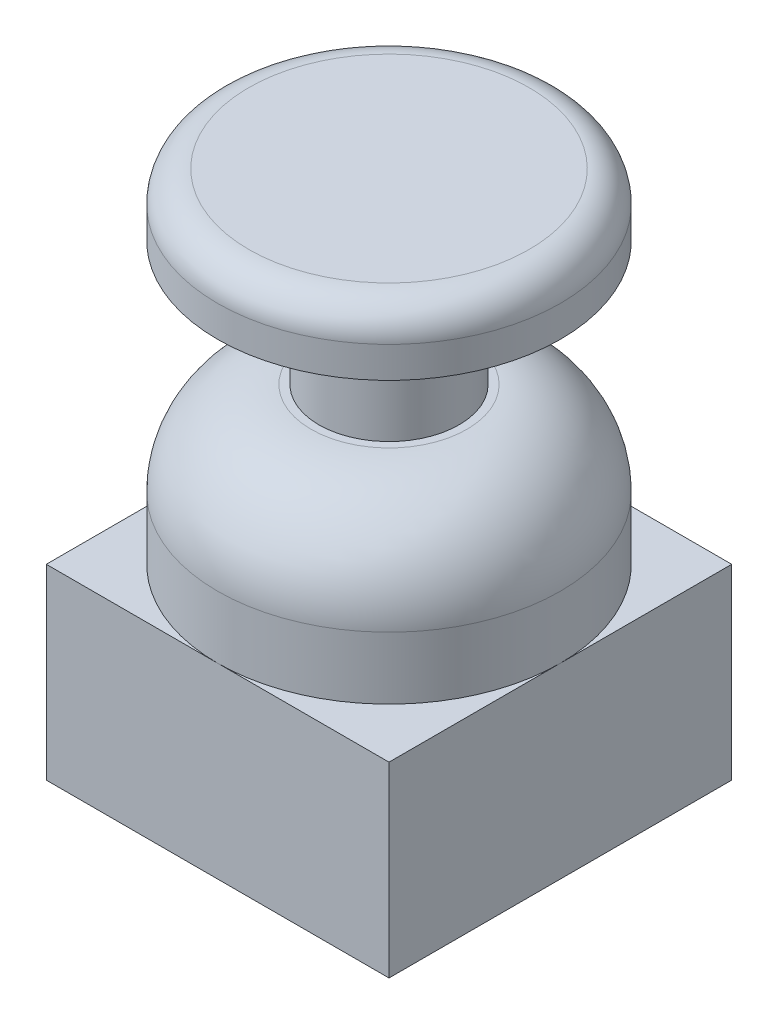
ISO-10303-21;
HEADER;
FILE_DESCRIPTION(('STEP AP214'),'2;1');
FILE_NAME('part.step','',(''),(''),'','','');
FILE_SCHEMA(('AUTOMOTIVE_DESIGN { 1 0 10303 214 1 1 1 1 }'));
ENDSEC;
DATA;
#1=APPLICATION_CONTEXT('core data for automotive mechanical design processes');
#2=APPLICATION_PROTOCOL_DEFINITION('international standard','automotive_design',2000,#1);
#3=PRODUCT_CONTEXT('',#1,'mechanical');
#4=PRODUCT('Part','Part','',(#3));
#5=PRODUCT_RELATED_PRODUCT_CATEGORY('part','',(#4));
#6=PRODUCT_DEFINITION_FORMATION('','',#4);
#7=PRODUCT_DEFINITION_CONTEXT('part definition',#1,'design');
#8=PRODUCT_DEFINITION('design','',#6,#7);
#9=PRODUCT_DEFINITION_SHAPE('','',#8);
#10=(LENGTH_UNIT() NAMED_UNIT(*) SI_UNIT(.MILLI.,.METRE.));
#11=(NAMED_UNIT(*) PLANE_ANGLE_UNIT() SI_UNIT($,.RADIAN.));
#12=(NAMED_UNIT(*) SI_UNIT($,.STERADIAN.) SOLID_ANGLE_UNIT());
#13=UNCERTAINTY_MEASURE_WITH_UNIT(LENGTH_MEASURE(1.E-05),#10,'distance_accuracy_value','');
#14=(GEOMETRIC_REPRESENTATION_CONTEXT(3) GLOBAL_UNCERTAINTY_ASSIGNED_CONTEXT((#13)) GLOBAL_UNIT_ASSIGNED_CONTEXT((#10,
#11,#12)) REPRESENTATION_CONTEXT('',''));
#15=CARTESIAN_POINT('',(0.,0.,0.));
#16=DIRECTION('',(0.,0.,1.));
#17=DIRECTION('',(1.,0.,0.));
#18=AXIS2_PLACEMENT_3D('',#15,#16,#17);
#19=CARTESIAN_POINT('',(0.,34.,0.));
#20=DIRECTION('',(0.,1.,0.));
#21=DIRECTION('',(0.,0.,1.));
#22=AXIS2_PLACEMENT_3D('',#19,#20,#21);
#23=CYLINDRICAL_SURFACE('',#22,11.);
#24=CARTESIAN_POINT('',(0.,16.,0.));
#25=DIRECTION('',(0.,1.,0.));
#26=DIRECTION('',(0.,0.,1.));
#27=AXIS2_PLACEMENT_3D('',#24,#25,#26);
#28=CIRCLE('',#27,11.);
#29=CARTESIAN_POINT('',(0.,16.,11.));
#30=VERTEX_POINT('',#29);
#31=EDGE_CURVE('E150',#30,#30,#28,.T.);
#32=ORIENTED_EDGE('',*,*,#31,.F.);
#33=EDGE_LOOP('',(#32));
#34=FACE_BOUND('',#33,.T.);
#35=CARTESIAN_POINT('',(0.,12.,0.));
#36=DIRECTION('',(0.,-1.,0.));
#37=DIRECTION('',(0.,0.,-1.));
#38=AXIS2_PLACEMENT_3D('',#35,#36,#37);
#39=CIRCLE('',#38,11.);
#40=CARTESIAN_POINT('',(11.,12.,0.));
#41=VERTEX_POINT('',#40);
#42=CARTESIAN_POINT('',(0.,12.,-11.));
#43=VERTEX_POINT('',#42);
#44=EDGE_CURVE('E37',#41,#43,#39,.F.);
#45=ORIENTED_EDGE('',*,*,#44,.T.);
#46=CARTESIAN_POINT('',(-11.,12.,0.));
#47=VERTEX_POINT('',#46);
#48=EDGE_CURVE('E11',#43,#47,#39,.F.);
#49=ORIENTED_EDGE('',*,*,#48,.T.);
#50=CARTESIAN_POINT('',(0.,12.,11.));
#51=VERTEX_POINT('',#50);
#52=EDGE_CURVE('E42',#47,#51,#39,.F.);
#53=ORIENTED_EDGE('',*,*,#52,.T.);
#54=EDGE_CURVE('E154',#51,#41,#39,.F.);
#55=ORIENTED_EDGE('',*,*,#54,.T.);
#56=EDGE_LOOP('',(#45,#49,#53,#55));
#57=FACE_BOUND('',#56,.T.);
#58=ADVANCED_FACE('F33',(#34,#57),#23,.T.);
#59=CARTESIAN_POINT('',(0.,16.,0.));
#60=DIRECTION('',(0.,1.,0.));
#61=DIRECTION('',(0.,0.,1.));
#62=AXIS2_PLACEMENT_3D('',#59,#60,#61);
#63=DEGENERATE_TOROIDAL_SURFACE('',#62,5.,6.,.T.);
#64=ORIENTED_EDGE('',*,*,#31,.T.);
#65=EDGE_LOOP('',(#64));
#66=FACE_BOUND('',#65,.T.);
#67=CARTESIAN_POINT('',(0.,22.,0.));
#68=DIRECTION('',(0.,1.,0.));
#69=DIRECTION('',(0.,0.,1.));
#70=AXIS2_PLACEMENT_3D('',#67,#68,#69);
#71=CIRCLE('',#70,4.99999999999996);
#72=CARTESIAN_POINT('',(0.,22.,4.99999999999996));
#73=VERTEX_POINT('',#72);
#74=EDGE_CURVE('E148',#73,#73,#71,.T.);
#75=ORIENTED_EDGE('',*,*,#74,.F.);
#76=EDGE_LOOP('',(#75));
#77=FACE_BOUND('',#76,.T.);
#78=ADVANCED_FACE('F181',(#66,#77),#63,.T.);
#79=CARTESIAN_POINT('',(-4.99999999999996,22.,0.));
#80=DIRECTION('',(0.,1.,0.));
#81=DIRECTION('',(0.,0.,1.));
#82=AXIS2_PLACEMENT_3D('',#79,#80,#81);
#83=PLANE('',#82);
#84=ORIENTED_EDGE('',*,*,#74,.T.);
#85=EDGE_LOOP('',(#84));
#86=FACE_BOUND('',#85,.T.);
#87=CARTESIAN_POINT('',(0.,22.,0.));
#88=DIRECTION('',(0.,1.,0.));
#89=DIRECTION('',(0.,0.,1.));
#90=AXIS2_PLACEMENT_3D('',#87,#88,#89);
#91=CIRCLE('',#90,4.5);
#92=CARTESIAN_POINT('',(0.,22.,4.5));
#93=VERTEX_POINT('',#92);
#94=EDGE_CURVE('E145',#93,#93,#91,.T.);
#95=ORIENTED_EDGE('',*,*,#94,.F.);
#96=EDGE_LOOP('',(#95));
#97=FACE_BOUND('',#96,.T.);
#98=ADVANCED_FACE('F188',(#86,#97),#83,.T.);
#99=CARTESIAN_POINT('',(0.,34.,0.));
#100=DIRECTION('',(0.,1.,0.));
#101=DIRECTION('',(0.,0.,1.));
#102=AXIS2_PLACEMENT_3D('',#99,#100,#101);
#103=CYLINDRICAL_SURFACE('',#102,4.5);
#104=ORIENTED_EDGE('',*,*,#94,.T.);
#105=EDGE_LOOP('',(#104));
#106=FACE_BOUND('',#105,.T.);
#107=CARTESIAN_POINT('',(0.,30.,0.));
#108=DIRECTION('',(0.,1.,0.));
#109=DIRECTION('',(0.,0.,1.));
#110=AXIS2_PLACEMENT_3D('',#107,#108,#109);
#111=CIRCLE('',#110,4.5);
#112=CARTESIAN_POINT('',(0.,30.,4.5));
#113=VERTEX_POINT('',#112);
#114=EDGE_CURVE('E142',#113,#113,#111,.T.);
#115=ORIENTED_EDGE('',*,*,#114,.F.);
#116=EDGE_LOOP('',(#115));
#117=FACE_BOUND('',#116,.T.);
#118=ADVANCED_FACE('F193',(#106,#117),#103,.T.);
#119=CARTESIAN_POINT('',(-4.5,30.,0.));
#120=DIRECTION('',(0.,-1.,0.));
#121=DIRECTION('',(0.,0.,-1.));
#122=AXIS2_PLACEMENT_3D('',#119,#120,#121);
#123=PLANE('',#122);
#124=ORIENTED_EDGE('',*,*,#114,.T.);
#125=EDGE_LOOP('',(#124));
#126=FACE_BOUND('',#125,.T.);
#127=CARTESIAN_POINT('',(0.,30.,0.));
#128=DIRECTION('',(0.,1.,0.));
#129=DIRECTION('',(0.,0.,1.));
#130=AXIS2_PLACEMENT_3D('',#127,#128,#129);
#131=CIRCLE('',#130,11.);
#132=CARTESIAN_POINT('',(0.,30.,11.));
#133=VERTEX_POINT('',#132);
#134=EDGE_CURVE('E139',#133,#133,#131,.T.);
#135=ORIENTED_EDGE('',*,*,#134,.F.);
#136=EDGE_LOOP('',(#135));
#137=FACE_BOUND('',#136,.T.);
#138=ADVANCED_FACE('F197',(#126,#137),#123,.T.);
#139=CARTESIAN_POINT('',(0.,34.,0.));
#140=DIRECTION('',(0.,1.,0.));
#141=DIRECTION('',(0.,0.,1.));
#142=AXIS2_PLACEMENT_3D('',#139,#140,#141);
#143=CYLINDRICAL_SURFACE('',#142,11.);
#144=ORIENTED_EDGE('',*,*,#134,.T.);
#145=EDGE_LOOP('',(#144));
#146=FACE_BOUND('',#145,.T.);
#147=CARTESIAN_POINT('',(0.,32.,0.));
#148=DIRECTION('',(0.,1.,0.));
#149=DIRECTION('',(0.,0.,1.));
#150=AXIS2_PLACEMENT_3D('',#147,#148,#149);
#151=CIRCLE('',#150,11.);
#152=CARTESIAN_POINT('',(0.,32.,11.));
#153=VERTEX_POINT('',#152);
#154=EDGE_CURVE('E136',#153,#153,#151,.T.);
#155=ORIENTED_EDGE('',*,*,#154,.F.);
#156=EDGE_LOOP('',(#155));
#157=FACE_BOUND('',#156,.T.);
#158=ADVANCED_FACE('F201',(#146,#157),#143,.T.);
#159=CARTESIAN_POINT('',(0.,32.,0.));
#160=DIRECTION('',(0.,1.,0.));
#161=DIRECTION('',(0.,0.,1.));
#162=AXIS2_PLACEMENT_3D('',#159,#160,#161);
#163=TOROIDAL_SURFACE('',#162,9.,2.);
#164=ORIENTED_EDGE('',*,*,#154,.T.);
#165=EDGE_LOOP('',(#164));
#166=FACE_BOUND('',#165,.T.);
#167=CARTESIAN_POINT('',(0.,34.,0.));
#168=DIRECTION('',(0.,1.,0.));
#169=DIRECTION('',(0.,0.,1.));
#170=AXIS2_PLACEMENT_3D('',#167,#168,#169);
#171=CIRCLE('',#170,8.99999999999998);
#172=CARTESIAN_POINT('',(0.,34.,8.99999999999998));
#173=VERTEX_POINT('',#172);
#174=EDGE_CURVE('E129',#173,#173,#171,.T.);
#175=ORIENTED_EDGE('',*,*,#174,.F.);
#176=EDGE_LOOP('',(#175));
#177=FACE_BOUND('',#176,.T.);
#178=ADVANCED_FACE('F205',(#166,#177),#163,.T.);
#179=CARTESIAN_POINT('',(-8.99999999999998,34.,0.));
#180=DIRECTION('',(0.,1.,0.));
#181=DIRECTION('',(0.,0.,1.));
#182=AXIS2_PLACEMENT_3D('',#179,#180,#181);
#183=PLANE('',#182);
#184=ORIENTED_EDGE('',*,*,#174,.T.);
#185=EDGE_LOOP('',(#184));
#186=FACE_BOUND('',#185,.T.);
#187=ADVANCED_FACE('F209',(#186),#183,.T.);
#188=CARTESIAN_POINT('',(-11.,12.,-11.));
#189=DIRECTION('',(-1.,0.,0.));
#190=DIRECTION('',(0.,0.,1.));
#191=AXIS2_PLACEMENT_3D('',#188,#189,#190);
#192=PLANE('',#191);
#193=DIRECTION('',(0.,0.,-1.));
#194=VECTOR('',#193,1.);
#195=CARTESIAN_POINT('',(-11.,0.,-11.));
#196=LINE('',#195,#194);
#197=CARTESIAN_POINT('',(-11.,0.,11.));
#198=VERTEX_POINT('',#197);
#199=CARTESIAN_POINT('',(-11.,0.,-11.));
#200=VERTEX_POINT('',#199);
#201=EDGE_CURVE('E118',#198,#200,#196,.T.);
#202=ORIENTED_EDGE('',*,*,#201,.F.);
#203=DIRECTION('',(0.,-1.,0.));
#204=VECTOR('',#203,1.);
#205=CARTESIAN_POINT('',(-11.,12.,11.));
#206=LINE('',#205,#204);
#207=CARTESIAN_POINT('',(-11.,12.,11.));
#208=VERTEX_POINT('',#207);
#209=EDGE_CURVE('E126',#208,#198,#206,.T.);
#210=ORIENTED_EDGE('',*,*,#209,.F.);
#211=DIRECTION('',(0.,0.,-1.));
#212=VECTOR('',#211,1.);
#213=CARTESIAN_POINT('',(-11.,12.,-11.));
#214=LINE('',#213,#212);
#215=EDGE_CURVE('E95',#208,#47,#214,.T.);
#216=ORIENTED_EDGE('',*,*,#215,.T.);
#217=CARTESIAN_POINT('',(-11.,12.,-11.));
#218=VERTEX_POINT('',#217);
#219=EDGE_CURVE('E89',#47,#218,#214,.T.);
#220=ORIENTED_EDGE('',*,*,#219,.T.);
#221=DIRECTION('',(0.,-1.,0.));
#222=VECTOR('',#221,1.);
#223=CARTESIAN_POINT('',(-11.,12.,-11.));
#224=LINE('',#223,#222);
#225=EDGE_CURVE('E91',#218,#200,#224,.T.);
#226=ORIENTED_EDGE('',*,*,#225,.T.);
#227=EDGE_LOOP('',(#202,#210,#216,#220,#226));
#228=FACE_BOUND('',#227,.T.);
#229=ADVANCED_FACE('F90',(#228),#192,.T.);
#230=CARTESIAN_POINT('',(11.,12.,11.));
#231=DIRECTION('',(0.,0.,1.));
#232=DIRECTION('',(1.,0.,0.));
#233=AXIS2_PLACEMENT_3D('',#230,#231,#232);
#234=PLANE('',#233);
#235=DIRECTION('',(-1.,0.,0.));
#236=VECTOR('',#235,1.);
#237=CARTESIAN_POINT('',(11.,0.,11.));
#238=LINE('',#237,#236);
#239=CARTESIAN_POINT('',(11.,0.,11.));
#240=VERTEX_POINT('',#239);
#241=EDGE_CURVE('E98',#240,#198,#238,.T.);
#242=ORIENTED_EDGE('',*,*,#241,.F.);
#243=DIRECTION('',(0.,-1.,0.));
#244=VECTOR('',#243,1.);
#245=CARTESIAN_POINT('',(11.,12.,11.));
#246=LINE('',#245,#244);
#247=CARTESIAN_POINT('',(11.,12.,11.));
#248=VERTEX_POINT('',#247);
#249=EDGE_CURVE('E130',#248,#240,#246,.T.);
#250=ORIENTED_EDGE('',*,*,#249,.F.);
#251=DIRECTION('',(-1.,0.,0.));
#252=VECTOR('',#251,1.);
#253=CARTESIAN_POINT('',(11.,12.,11.));
#254=LINE('',#253,#252);
#255=EDGE_CURVE('E105',#248,#51,#254,.T.);
#256=ORIENTED_EDGE('',*,*,#255,.T.);
#257=EDGE_CURVE('E115',#51,#208,#254,.T.);
#258=ORIENTED_EDGE('',*,*,#257,.T.);
#259=ORIENTED_EDGE('',*,*,#209,.T.);
#260=EDGE_LOOP('',(#242,#250,#256,#258,#259));
#261=FACE_BOUND('',#260,.T.);
#262=ADVANCED_FACE('F164',(#261),#234,.T.);
#263=CARTESIAN_POINT('',(11.,12.,-11.));
#264=DIRECTION('',(1.,0.,0.));
#265=DIRECTION('',(0.,0.,-1.));
#266=AXIS2_PLACEMENT_3D('',#263,#264,#265);
#267=PLANE('',#266);
#268=DIRECTION('',(0.,0.,1.));
#269=VECTOR('',#268,1.);
#270=CARTESIAN_POINT('',(11.,0.,-11.));
#271=LINE('',#270,#269);
#272=CARTESIAN_POINT('',(11.,0.,-11.));
#273=VERTEX_POINT('',#272);
#274=EDGE_CURVE('E121',#273,#240,#271,.T.);
#275=ORIENTED_EDGE('',*,*,#274,.F.);
#276=DIRECTION('',(0.,-1.,0.));
#277=VECTOR('',#276,1.);
#278=CARTESIAN_POINT('',(11.,12.,-11.));
#279=LINE('',#278,#277);
#280=CARTESIAN_POINT('',(11.,12.,-11.));
#281=VERTEX_POINT('',#280);
#282=EDGE_CURVE('E104',#281,#273,#279,.T.);
#283=ORIENTED_EDGE('',*,*,#282,.F.);
#284=DIRECTION('',(0.,0.,1.));
#285=VECTOR('',#284,1.);
#286=CARTESIAN_POINT('',(11.,12.,-11.));
#287=LINE('',#286,#285);
#288=EDGE_CURVE('E111',#281,#41,#287,.T.);
#289=ORIENTED_EDGE('',*,*,#288,.T.);
#290=EDGE_CURVE('E108',#41,#248,#287,.T.);
#291=ORIENTED_EDGE('',*,*,#290,.T.);
#292=ORIENTED_EDGE('',*,*,#249,.T.);
#293=EDGE_LOOP('',(#275,#283,#289,#291,#292));
#294=FACE_BOUND('',#293,.T.);
#295=ADVANCED_FACE('F169',(#294),#267,.T.);
#296=CARTESIAN_POINT('',(11.,12.,-11.));
#297=DIRECTION('',(0.,0.,-1.));
#298=DIRECTION('',(-1.,0.,0.));
#299=AXIS2_PLACEMENT_3D('',#296,#297,#298);
#300=PLANE('',#299);
#301=ORIENTED_EDGE('',*,*,#282,.T.);
#302=DIRECTION('',(1.,0.,0.));
#303=VECTOR('',#302,1.);
#304=CARTESIAN_POINT('',(11.,0.,-11.));
#305=LINE('',#304,#303);
#306=EDGE_CURVE('E103',#200,#273,#305,.T.);
#307=ORIENTED_EDGE('',*,*,#306,.F.);
#308=ORIENTED_EDGE('',*,*,#225,.F.);
#309=DIRECTION('',(1.,0.,0.));
#310=VECTOR('',#309,1.);
#311=CARTESIAN_POINT('',(11.,12.,-11.));
#312=LINE('',#311,#310);
#313=EDGE_CURVE('E49',#218,#43,#312,.T.);
#314=ORIENTED_EDGE('',*,*,#313,.T.);
#315=EDGE_CURVE('E109',#43,#281,#312,.T.);
#316=ORIENTED_EDGE('',*,*,#315,.T.);
#317=EDGE_LOOP('',(#301,#307,#308,#314,#316));
#318=FACE_BOUND('',#317,.T.);
#319=ADVANCED_FACE('F101',(#318),#300,.T.);
#320=CARTESIAN_POINT('',(0.,12.,0.));
#321=DIRECTION('',(0.,-1.,0.));
#322=DIRECTION('',(0.,0.,-1.));
#323=AXIS2_PLACEMENT_3D('',#320,#321,#322);
#324=PLANE('',#323);
#325=ORIENTED_EDGE('',*,*,#48,.F.);
#326=ORIENTED_EDGE('',*,*,#313,.F.);
#327=ORIENTED_EDGE('',*,*,#219,.F.);
#328=EDGE_LOOP('',(#325,#326,#327));
#329=FACE_BOUND('',#328,.T.);
#330=ADVANCED_FACE('F107',(#329),#324,.F.);
#331=ORIENTED_EDGE('',*,*,#52,.F.);
#332=ORIENTED_EDGE('',*,*,#215,.F.);
#333=ORIENTED_EDGE('',*,*,#257,.F.);
#334=EDGE_LOOP('',(#331,#332,#333));
#335=FACE_BOUND('',#334,.T.);
#336=ADVANCED_FACE('F160',(#335),#324,.F.);
#337=ORIENTED_EDGE('',*,*,#54,.F.);
#338=ORIENTED_EDGE('',*,*,#255,.F.);
#339=ORIENTED_EDGE('',*,*,#290,.F.);
#340=EDGE_LOOP('',(#337,#338,#339));
#341=FACE_BOUND('',#340,.T.);
#342=ADVANCED_FACE('F166',(#341),#324,.F.);
#343=ORIENTED_EDGE('',*,*,#44,.F.);
#344=ORIENTED_EDGE('',*,*,#288,.F.);
#345=ORIENTED_EDGE('',*,*,#315,.F.);
#346=EDGE_LOOP('',(#343,#344,#345));
#347=FACE_BOUND('',#346,.T.);
#348=ADVANCED_FACE('F170',(#347),#324,.F.);
#349=CARTESIAN_POINT('',(0.,0.,0.));
#350=DIRECTION('',(0.,-1.,0.));
#351=DIRECTION('',(0.,0.,-1.));
#352=AXIS2_PLACEMENT_3D('',#349,#350,#351);
#353=PLANE('',#352);
#354=ORIENTED_EDGE('',*,*,#306,.T.);
#355=ORIENTED_EDGE('',*,*,#274,.T.);
#356=ORIENTED_EDGE('',*,*,#241,.T.);
#357=ORIENTED_EDGE('',*,*,#201,.T.);
#358=EDGE_LOOP('',(#354,#355,#356,#357));
#359=FACE_BOUND('',#358,.T.);
#360=ADVANCED_FACE('F35',(#359),#353,.T.);
#361=CLOSED_SHELL('',(#58,#78,#98,#118,#138,#158,#178,#187,#229,#262,#295,#319,#330,#336,#342,
#348,#360));
#362=MANIFOLD_SOLID_BREP('B2',#361);
#363=ADVANCED_BREP_SHAPE_REPRESENTATION('',(#18,#362),#14);
#364=SHAPE_DEFINITION_REPRESENTATION(#9,#363);
ENDSEC;
END-ISO-10303-21;
